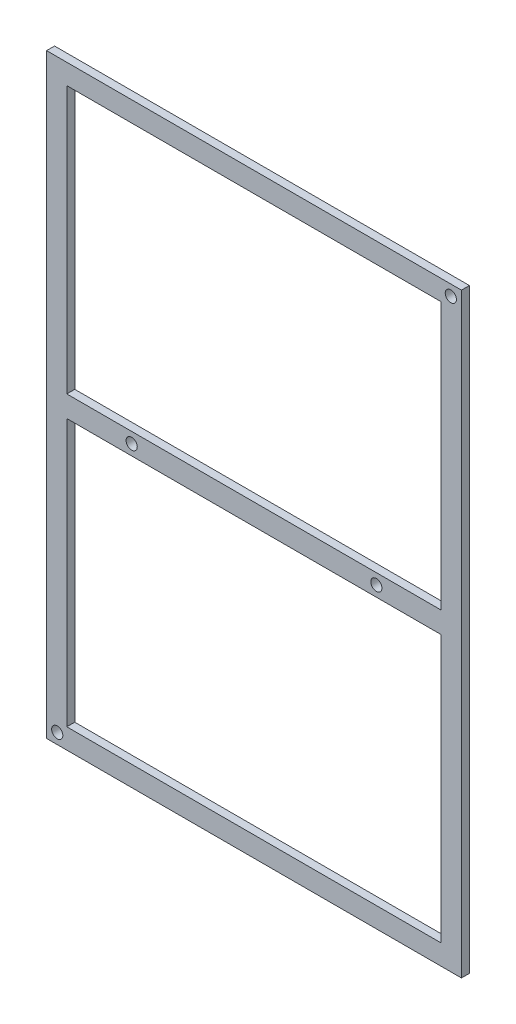
ISO-10303-21;
HEADER;
FILE_DESCRIPTION(('STEP AP214'),'2;1');
FILE_NAME('part.step','',(''),(''),'','','');
FILE_SCHEMA(('AUTOMOTIVE_DESIGN { 1 0 10303 214 1 1 1 1 }'));
ENDSEC;
DATA;
#1=APPLICATION_CONTEXT('core data for automotive mechanical design processes');
#2=APPLICATION_PROTOCOL_DEFINITION('international standard','automotive_design',2000,#1);
#3=PRODUCT_CONTEXT('',#1,'mechanical');
#4=PRODUCT('Part','Part','',(#3));
#5=PRODUCT_RELATED_PRODUCT_CATEGORY('part','',(#4));
#6=PRODUCT_DEFINITION_FORMATION('','',#4);
#7=PRODUCT_DEFINITION_CONTEXT('part definition',#1,'design');
#8=PRODUCT_DEFINITION('design','',#6,#7);
#9=PRODUCT_DEFINITION_SHAPE('','',#8);
#10=(LENGTH_UNIT() NAMED_UNIT(*) SI_UNIT(.MILLI.,.METRE.));
#11=(NAMED_UNIT(*) PLANE_ANGLE_UNIT() SI_UNIT($,.RADIAN.));
#12=(NAMED_UNIT(*) SI_UNIT($,.STERADIAN.) SOLID_ANGLE_UNIT());
#13=UNCERTAINTY_MEASURE_WITH_UNIT(LENGTH_MEASURE(1.E-05),#10,'distance_accuracy_value','');
#14=(GEOMETRIC_REPRESENTATION_CONTEXT(3) GLOBAL_UNCERTAINTY_ASSIGNED_CONTEXT((#13)) GLOBAL_UNIT_ASSIGNED_CONTEXT((#10,
#11,#12)) REPRESENTATION_CONTEXT('',''));
#15=CARTESIAN_POINT('',(0.,0.,0.));
#16=DIRECTION('',(0.,0.,1.));
#17=DIRECTION('',(1.,0.,0.));
#18=AXIS2_PLACEMENT_3D('',#15,#16,#17);
#19=CARTESIAN_POINT('',(-35.1999999999999,0.,1.5));
#20=DIRECTION('',(1.,0.,0.));
#21=DIRECTION('',(0.,0.,-1.));
#22=AXIS2_PLACEMENT_3D('',#19,#20,#21);
#23=PLANE('',#22);
#24=DIRECTION('',(0.,0.,1.));
#25=VECTOR('',#24,1.);
#26=CARTESIAN_POINT('',(-35.1999999999999,1.99999999999999,-70.513544798145));
#27=LINE('',#26,#25);
#28=CARTESIAN_POINT('',(-35.1999999999999,1.99999999999999,0.));
#29=VERTEX_POINT('',#28);
#30=CARTESIAN_POINT('',(-35.1999999999999,1.99999999999999,1.5));
#31=VERTEX_POINT('',#30);
#32=EDGE_CURVE('E222',#29,#31,#27,.T.);
#33=ORIENTED_EDGE('',*,*,#32,.F.);
#34=DIRECTION('',(0.,-1.,0.));
#35=VECTOR('',#34,1.);
#36=CARTESIAN_POINT('',(-35.1999999999999,0.,0.));
#37=LINE('',#36,#35);
#38=CARTESIAN_POINT('',(-35.1999999999999,52.1999999999998,0.));
#39=VERTEX_POINT('',#38);
#40=EDGE_CURVE('E182',#39,#29,#37,.T.);
#41=ORIENTED_EDGE('',*,*,#40,.F.);
#42=DIRECTION('',(0.,0.,-1.));
#43=VECTOR('',#42,1.);
#44=CARTESIAN_POINT('',(-35.1999999999999,52.1999999999998,1.5));
#45=LINE('',#44,#43);
#46=CARTESIAN_POINT('',(-35.1999999999999,52.1999999999998,1.5));
#47=VERTEX_POINT('',#46);
#48=EDGE_CURVE('E211',#47,#39,#45,.T.);
#49=ORIENTED_EDGE('',*,*,#48,.F.);
#50=DIRECTION('',(0.,-1.,0.));
#51=VECTOR('',#50,1.);
#52=CARTESIAN_POINT('',(-35.1999999999999,0.,1.5));
#53=LINE('',#52,#51);
#54=EDGE_CURVE('E155',#47,#31,#53,.T.);
#55=ORIENTED_EDGE('',*,*,#54,.T.);
#56=EDGE_LOOP('',(#33,#41,#49,#55));
#57=FACE_BOUND('',#56,.T.);
#58=ADVANCED_FACE('F39',(#57),#23,.T.);
#59=CARTESIAN_POINT('',(35.2000000000001,0.,1.5));
#60=DIRECTION('',(1.,0.,0.));
#61=DIRECTION('',(0.,0.,-1.));
#62=AXIS2_PLACEMENT_3D('',#59,#60,#61);
#63=PLANE('',#62);
#64=DIRECTION('',(0.,-1.,0.));
#65=VECTOR('',#64,1.);
#66=CARTESIAN_POINT('',(35.2000000000001,0.,0.));
#67=LINE('',#66,#65);
#68=CARTESIAN_POINT('',(35.2000000000001,52.1999999999998,0.));
#69=VERTEX_POINT('',#68);
#70=CARTESIAN_POINT('',(35.2000000000001,1.99999999999999,0.));
#71=VERTEX_POINT('',#70);
#72=EDGE_CURVE('E188',#69,#71,#67,.T.);
#73=ORIENTED_EDGE('',*,*,#72,.T.);
#74=DIRECTION('',(0.,0.,1.));
#75=VECTOR('',#74,1.);
#76=CARTESIAN_POINT('',(35.2000000000001,1.99999999999999,-70.513544798145));
#77=LINE('',#76,#75);
#78=CARTESIAN_POINT('',(35.2000000000001,1.99999999999999,1.5));
#79=VERTEX_POINT('',#78);
#80=EDGE_CURVE('E64',#71,#79,#77,.T.);
#81=ORIENTED_EDGE('',*,*,#80,.T.);
#82=DIRECTION('',(0.,-1.,0.));
#83=VECTOR('',#82,1.);
#84=CARTESIAN_POINT('',(35.2000000000001,0.,1.5));
#85=LINE('',#84,#83);
#86=CARTESIAN_POINT('',(35.2000000000001,52.1999999999998,1.5));
#87=VERTEX_POINT('',#86);
#88=EDGE_CURVE('E164',#87,#79,#85,.T.);
#89=ORIENTED_EDGE('',*,*,#88,.F.);
#90=DIRECTION('',(0.,0.,-1.));
#91=VECTOR('',#90,1.);
#92=CARTESIAN_POINT('',(35.2000000000001,52.1999999999998,1.5));
#93=LINE('',#92,#91);
#94=EDGE_CURVE('E209',#87,#69,#93,.T.);
#95=ORIENTED_EDGE('',*,*,#94,.T.);
#96=EDGE_LOOP('',(#73,#81,#89,#95));
#97=FACE_BOUND('',#96,.T.);
#98=ADVANCED_FACE('F289',(#97),#63,.F.);
#99=CARTESIAN_POINT('',(0.,55.9999999999998,1.5));
#100=DIRECTION('',(0.,1.,0.));
#101=DIRECTION('',(0.,0.,1.));
#102=AXIS2_PLACEMENT_3D('',#99,#100,#101);
#103=PLANE('',#102);
#104=DIRECTION('',(1.,0.,0.));
#105=VECTOR('',#104,1.);
#106=CARTESIAN_POINT('',(0.,55.9999999999998,0.));
#107=LINE('',#106,#105);
#108=CARTESIAN_POINT('',(-38.9999999999999,55.9999999999998,0.));
#109=VERTEX_POINT('',#108);
#110=CARTESIAN_POINT('',(39.0000000000001,55.9999999999998,0.));
#111=VERTEX_POINT('',#110);
#112=EDGE_CURVE('E190',#109,#111,#107,.T.);
#113=ORIENTED_EDGE('',*,*,#112,.F.);
#114=DIRECTION('',(0.,0.,-1.));
#115=VECTOR('',#114,1.);
#116=CARTESIAN_POINT('',(-38.9999999999999,55.9999999999998,1.5));
#117=LINE('',#116,#115);
#118=CARTESIAN_POINT('',(-38.9999999999999,55.9999999999998,1.5));
#119=VERTEX_POINT('',#118);
#120=EDGE_CURVE('E11',#119,#109,#117,.T.);
#121=ORIENTED_EDGE('',*,*,#120,.F.);
#122=DIRECTION('',(1.,0.,0.));
#123=VECTOR('',#122,1.);
#124=CARTESIAN_POINT('',(0.,55.9999999999998,1.5));
#125=LINE('',#124,#123);
#126=CARTESIAN_POINT('',(39.0000000000001,55.9999999999998,1.5));
#127=VERTEX_POINT('',#126);
#128=EDGE_CURVE('E166',#119,#127,#125,.T.);
#129=ORIENTED_EDGE('',*,*,#128,.T.);
#130=DIRECTION('',(0.,0.,-1.));
#131=VECTOR('',#130,1.);
#132=CARTESIAN_POINT('',(39.0000000000001,55.9999999999998,1.5));
#133=LINE('',#132,#131);
#134=EDGE_CURVE('E201',#127,#111,#133,.T.);
#135=ORIENTED_EDGE('',*,*,#134,.T.);
#136=EDGE_LOOP('',(#113,#121,#129,#135));
#137=FACE_BOUND('',#136,.T.);
#138=ADVANCED_FACE('F294',(#137),#103,.T.);
#139=CARTESIAN_POINT('',(-38.9999999999999,0.,1.5));
#140=DIRECTION('',(1.,0.,0.));
#141=DIRECTION('',(0.,1.,0.));
#142=AXIS2_PLACEMENT_3D('',#139,#140,#141);
#143=PLANE('',#142);
#144=DIRECTION('',(0.,-1.,0.));
#145=VECTOR('',#144,1.);
#146=CARTESIAN_POINT('',(-38.9999999999999,0.,0.));
#147=LINE('',#146,#145);
#148=CARTESIAN_POINT('',(-38.9999999999999,-56.0000000000003,0.));
#149=VERTEX_POINT('',#148);
#150=EDGE_CURVE('E193',#109,#149,#147,.T.);
#151=ORIENTED_EDGE('',*,*,#150,.T.);
#152=DIRECTION('',(0.,0.,-1.));
#153=VECTOR('',#152,1.);
#154=CARTESIAN_POINT('',(-38.9999999999999,-56.0000000000003,1.5));
#155=LINE('',#154,#153);
#156=CARTESIAN_POINT('',(-38.9999999999999,-56.0000000000003,1.5));
#157=VERTEX_POINT('',#156);
#158=EDGE_CURVE('E48',#157,#149,#155,.T.);
#159=ORIENTED_EDGE('',*,*,#158,.F.);
#160=DIRECTION('',(0.,-1.,0.));
#161=VECTOR('',#160,1.);
#162=CARTESIAN_POINT('',(-38.9999999999999,0.,1.5));
#163=LINE('',#162,#161);
#164=EDGE_CURVE('E169',#119,#157,#163,.T.);
#165=ORIENTED_EDGE('',*,*,#164,.F.);
#166=ORIENTED_EDGE('',*,*,#120,.T.);
#167=EDGE_LOOP('',(#151,#159,#165,#166));
#168=FACE_BOUND('',#167,.T.);
#169=ADVANCED_FACE('F309',(#168),#143,.F.);
#170=CARTESIAN_POINT('',(0.,-56.0000000000003,1.5));
#171=DIRECTION('',(0.,1.,0.));
#172=DIRECTION('',(0.,0.,1.));
#173=AXIS2_PLACEMENT_3D('',#170,#171,#172);
#174=PLANE('',#173);
#175=DIRECTION('',(1.,0.,0.));
#176=VECTOR('',#175,1.);
#177=CARTESIAN_POINT('',(0.,-56.0000000000003,0.));
#178=LINE('',#177,#176);
#179=CARTESIAN_POINT('',(39.0000000000001,-56.0000000000003,0.));
#180=VERTEX_POINT('',#179);
#181=EDGE_CURVE('E196',#149,#180,#178,.T.);
#182=ORIENTED_EDGE('',*,*,#181,.T.);
#183=DIRECTION('',(0.,0.,-1.));
#184=VECTOR('',#183,1.);
#185=CARTESIAN_POINT('',(39.0000000000001,-56.0000000000003,1.5));
#186=LINE('',#185,#184);
#187=CARTESIAN_POINT('',(39.0000000000001,-56.0000000000003,1.5));
#188=VERTEX_POINT('',#187);
#189=EDGE_CURVE('E203',#188,#180,#186,.T.);
#190=ORIENTED_EDGE('',*,*,#189,.F.);
#191=DIRECTION('',(1.,0.,0.));
#192=VECTOR('',#191,1.);
#193=CARTESIAN_POINT('',(0.,-56.0000000000003,1.5));
#194=LINE('',#193,#192);
#195=EDGE_CURVE('E172',#157,#188,#194,.T.);
#196=ORIENTED_EDGE('',*,*,#195,.F.);
#197=ORIENTED_EDGE('',*,*,#158,.T.);
#198=EDGE_LOOP('',(#182,#190,#196,#197));
#199=FACE_BOUND('',#198,.T.);
#200=ADVANCED_FACE('F305',(#199),#174,.F.);
#201=CARTESIAN_POINT('',(0.,-52.2000000000003,1.5));
#202=DIRECTION('',(0.,1.,0.));
#203=DIRECTION('',(0.,0.,1.));
#204=AXIS2_PLACEMENT_3D('',#201,#202,#203);
#205=PLANE('',#204);
#206=DIRECTION('',(1.,0.,0.));
#207=VECTOR('',#206,1.);
#208=CARTESIAN_POINT('',(0.,-52.2000000000003,0.));
#209=LINE('',#208,#207);
#210=CARTESIAN_POINT('',(-35.1999999999999,-52.2000000000003,0.));
#211=VERTEX_POINT('',#210);
#212=CARTESIAN_POINT('',(35.2000000000001,-52.2000000000003,0.));
#213=VERTEX_POINT('',#212);
#214=EDGE_CURVE('E178',#211,#213,#209,.T.);
#215=ORIENTED_EDGE('',*,*,#214,.F.);
#216=DIRECTION('',(0.,0.,-1.));
#217=VECTOR('',#216,1.);
#218=CARTESIAN_POINT('',(-35.1999999999999,-52.2000000000003,1.5));
#219=LINE('',#218,#217);
#220=CARTESIAN_POINT('',(-35.1999999999999,-52.2000000000003,1.5));
#221=VERTEX_POINT('',#220);
#222=EDGE_CURVE('E43',#221,#211,#219,.T.);
#223=ORIENTED_EDGE('',*,*,#222,.F.);
#224=DIRECTION('',(1.,0.,0.));
#225=VECTOR('',#224,1.);
#226=CARTESIAN_POINT('',(0.,-52.2000000000003,1.5));
#227=LINE('',#226,#225);
#228=CARTESIAN_POINT('',(35.2000000000001,-52.2000000000003,1.5));
#229=VERTEX_POINT('',#228);
#230=EDGE_CURVE('E154',#221,#229,#227,.T.);
#231=ORIENTED_EDGE('',*,*,#230,.T.);
#232=DIRECTION('',(0.,0.,-1.));
#233=VECTOR('',#232,1.);
#234=CARTESIAN_POINT('',(35.2000000000001,-52.2000000000003,1.5));
#235=LINE('',#234,#233);
#236=EDGE_CURVE('E177',#229,#213,#235,.T.);
#237=ORIENTED_EDGE('',*,*,#236,.T.);
#238=EDGE_LOOP('',(#215,#223,#231,#237));
#239=FACE_BOUND('',#238,.T.);
#240=ADVANCED_FACE('F41',(#239),#205,.T.);
#241=DIRECTION('',(0.,0.,1.));
#242=VECTOR('',#241,1.);
#243=CARTESIAN_POINT('',(-35.1999999999999,-1.99999999999999,-70.513544798145));
#244=LINE('',#243,#242);
#245=CARTESIAN_POINT('',(-35.1999999999999,-1.99999999999999,0.));
#246=VERTEX_POINT('',#245);
#247=CARTESIAN_POINT('',(-35.1999999999999,-1.99999999999999,1.5));
#248=VERTEX_POINT('',#247);
#249=EDGE_CURVE('E134',#246,#248,#244,.T.);
#250=ORIENTED_EDGE('',*,*,#249,.T.);
#251=EDGE_CURVE('E146',#248,#221,#53,.T.);
#252=ORIENTED_EDGE('',*,*,#251,.T.);
#253=ORIENTED_EDGE('',*,*,#222,.T.);
#254=EDGE_CURVE('E148',#246,#211,#37,.T.);
#255=ORIENTED_EDGE('',*,*,#254,.F.);
#256=EDGE_LOOP('',(#250,#252,#253,#255));
#257=FACE_BOUND('',#256,.T.);
#258=ADVANCED_FACE('F144',(#257),#23,.T.);
#259=CARTESIAN_POINT('',(0.,52.1999999999998,1.5));
#260=DIRECTION('',(0.,1.,0.));
#261=DIRECTION('',(0.,0.,1.));
#262=AXIS2_PLACEMENT_3D('',#259,#260,#261);
#263=PLANE('',#262);
#264=DIRECTION('',(1.,0.,0.));
#265=VECTOR('',#264,1.);
#266=CARTESIAN_POINT('',(0.,52.1999999999998,0.));
#267=LINE('',#266,#265);
#268=EDGE_CURVE('E185',#39,#69,#267,.T.);
#269=ORIENTED_EDGE('',*,*,#268,.T.);
#270=ORIENTED_EDGE('',*,*,#94,.F.);
#271=DIRECTION('',(1.,0.,0.));
#272=VECTOR('',#271,1.);
#273=CARTESIAN_POINT('',(0.,52.1999999999998,1.5));
#274=LINE('',#273,#272);
#275=EDGE_CURVE('E158',#47,#87,#274,.T.);
#276=ORIENTED_EDGE('',*,*,#275,.F.);
#277=ORIENTED_EDGE('',*,*,#48,.T.);
#278=EDGE_LOOP('',(#269,#270,#276,#277));
#279=FACE_BOUND('',#278,.T.);
#280=ADVANCED_FACE('F300',(#279),#263,.F.);
#281=CARTESIAN_POINT('',(35.2000000000001,-1.99999999999999,1.5));
#282=VERTEX_POINT('',#281);
#283=EDGE_CURVE('E56',#282,#229,#85,.T.);
#284=ORIENTED_EDGE('',*,*,#283,.F.);
#285=DIRECTION('',(0.,0.,1.));
#286=VECTOR('',#285,1.);
#287=CARTESIAN_POINT('',(35.2000000000001,-1.99999999999999,-70.513544798145));
#288=LINE('',#287,#286);
#289=CARTESIAN_POINT('',(35.2000000000001,-1.99999999999999,0.));
#290=VERTEX_POINT('',#289);
#291=EDGE_CURVE('E136',#290,#282,#288,.T.);
#292=ORIENTED_EDGE('',*,*,#291,.F.);
#293=EDGE_CURVE('E187',#290,#213,#67,.T.);
#294=ORIENTED_EDGE('',*,*,#293,.T.);
#295=ORIENTED_EDGE('',*,*,#236,.F.);
#296=EDGE_LOOP('',(#284,#292,#294,#295));
#297=FACE_BOUND('',#296,.T.);
#298=ADVANCED_FACE('F296',(#297),#63,.F.);
#299=CARTESIAN_POINT('',(39.0000000000001,0.,1.5));
#300=DIRECTION('',(1.,0.,0.));
#301=DIRECTION('',(0.,1.,0.));
#302=AXIS2_PLACEMENT_3D('',#299,#300,#301);
#303=PLANE('',#302);
#304=DIRECTION('',(0.,-1.,0.));
#305=VECTOR('',#304,1.);
#306=CARTESIAN_POINT('',(39.0000000000001,0.,0.));
#307=LINE('',#306,#305);
#308=EDGE_CURVE('E159',#111,#180,#307,.T.);
#309=ORIENTED_EDGE('',*,*,#308,.F.);
#310=ORIENTED_EDGE('',*,*,#134,.F.);
#311=DIRECTION('',(0.,-1.,0.));
#312=VECTOR('',#311,1.);
#313=CARTESIAN_POINT('',(39.0000000000001,0.,1.5));
#314=LINE('',#313,#312);
#315=EDGE_CURVE('E174',#127,#188,#314,.T.);
#316=ORIENTED_EDGE('',*,*,#315,.T.);
#317=ORIENTED_EDGE('',*,*,#189,.T.);
#318=EDGE_LOOP('',(#309,#310,#316,#317));
#319=FACE_BOUND('',#318,.T.);
#320=ADVANCED_FACE('F265',(#319),#303,.T.);
#321=CARTESIAN_POINT('',(0.,0.,1.5));
#322=DIRECTION('',(0.,0.,1.));
#323=DIRECTION('',(1.,0.,0.));
#324=AXIS2_PLACEMENT_3D('',#321,#322,#323);
#325=PLANE('',#324);
#326=CARTESIAN_POINT('',(37.0000000000001,53.9999999999998,1.5));
#327=DIRECTION('',(0.,0.,1.));
#328=DIRECTION('',(1.,0.,0.));
#329=AXIS2_PLACEMENT_3D('',#326,#327,#328);
#330=CIRCLE('',#329,1.05);
#331=CARTESIAN_POINT('',(38.0500000000001,53.9999999999998,1.5));
#332=VERTEX_POINT('',#331);
#333=EDGE_CURVE('E248',#332,#332,#330,.T.);
#334=ORIENTED_EDGE('',*,*,#333,.F.);
#335=EDGE_LOOP('',(#334));
#336=FACE_BOUND('',#335,.T.);
#337=CARTESIAN_POINT('',(23.0000000000001,0.,1.5));
#338=DIRECTION('',(0.,0.,1.));
#339=DIRECTION('',(1.,0.,0.));
#340=AXIS2_PLACEMENT_3D('',#337,#338,#339);
#341=CIRCLE('',#340,1.05);
#342=CARTESIAN_POINT('',(24.0500000000001,0.,1.5));
#343=VERTEX_POINT('',#342);
#344=EDGE_CURVE('E245',#343,#343,#341,.T.);
#345=ORIENTED_EDGE('',*,*,#344,.F.);
#346=EDGE_LOOP('',(#345));
#347=FACE_BOUND('',#346,.T.);
#348=CARTESIAN_POINT('',(-22.9999999999999,0.,1.5));
#349=DIRECTION('',(0.,0.,1.));
#350=DIRECTION('',(1.,0.,0.));
#351=AXIS2_PLACEMENT_3D('',#348,#349,#350);
#352=CIRCLE('',#351,1.05);
#353=CARTESIAN_POINT('',(-21.9499999999999,0.,1.5));
#354=VERTEX_POINT('',#353);
#355=EDGE_CURVE('E239',#354,#354,#352,.T.);
#356=ORIENTED_EDGE('',*,*,#355,.F.);
#357=EDGE_LOOP('',(#356));
#358=FACE_BOUND('',#357,.T.);
#359=CARTESIAN_POINT('',(-36.9999999999999,-54.0000000000003,1.5));
#360=DIRECTION('',(0.,0.,1.));
#361=DIRECTION('',(1.,0.,0.));
#362=AXIS2_PLACEMENT_3D('',#359,#360,#361);
#363=CIRCLE('',#362,1.05);
#364=CARTESIAN_POINT('',(-35.9499999999999,-54.0000000000003,1.5));
#365=VERTEX_POINT('',#364);
#366=EDGE_CURVE('E233',#365,#365,#363,.T.);
#367=ORIENTED_EDGE('',*,*,#366,.F.);
#368=EDGE_LOOP('',(#367));
#369=FACE_BOUND('',#368,.T.);
#370=ORIENTED_EDGE('',*,*,#251,.F.);
#371=DIRECTION('',(1.,0.,0.));
#372=VECTOR('',#371,1.);
#373=CARTESIAN_POINT('',(-35.1999999999999,-1.99999999999999,1.5));
#374=LINE('',#373,#372);
#375=EDGE_CURVE('E130',#248,#282,#374,.T.);
#376=ORIENTED_EDGE('',*,*,#375,.T.);
#377=ORIENTED_EDGE('',*,*,#283,.T.);
#378=ORIENTED_EDGE('',*,*,#230,.F.);
#379=EDGE_LOOP('',(#370,#376,#377,#378));
#380=FACE_BOUND('',#379,.T.);
#381=DIRECTION('',(-1.,0.,0.));
#382=VECTOR('',#381,1.);
#383=CARTESIAN_POINT('',(-35.1999999999999,1.99999999999999,1.5));
#384=LINE('',#383,#382);
#385=EDGE_CURVE('E139',#79,#31,#384,.T.);
#386=ORIENTED_EDGE('',*,*,#385,.T.);
#387=ORIENTED_EDGE('',*,*,#54,.F.);
#388=ORIENTED_EDGE('',*,*,#275,.T.);
#389=ORIENTED_EDGE('',*,*,#88,.T.);
#390=EDGE_LOOP('',(#386,#387,#388,#389));
#391=FACE_BOUND('',#390,.T.);
#392=ORIENTED_EDGE('',*,*,#128,.F.);
#393=ORIENTED_EDGE('',*,*,#164,.T.);
#394=ORIENTED_EDGE('',*,*,#195,.T.);
#395=ORIENTED_EDGE('',*,*,#315,.F.);
#396=EDGE_LOOP('',(#392,#393,#394,#395));
#397=FACE_BOUND('',#396,.T.);
#398=ADVANCED_FACE('F151',(#336,#347,#358,#369,#380,#391,#397),#325,.T.);
#399=CARTESIAN_POINT('',(0.,0.,0.));
#400=DIRECTION('',(0.,0.,1.));
#401=DIRECTION('',(1.,0.,0.));
#402=AXIS2_PLACEMENT_3D('',#399,#400,#401);
#403=PLANE('',#402);
#404=CARTESIAN_POINT('',(37.0000000000001,53.9999999999998,0.));
#405=DIRECTION('',(0.,0.,1.));
#406=DIRECTION('',(1.,0.,0.));
#407=AXIS2_PLACEMENT_3D('',#404,#405,#406);
#408=CIRCLE('',#407,1.05);
#409=CARTESIAN_POINT('',(38.0500000000001,53.9999999999998,0.));
#410=VERTEX_POINT('',#409);
#411=EDGE_CURVE('E140',#410,#410,#408,.T.);
#412=ORIENTED_EDGE('',*,*,#411,.T.);
#413=EDGE_LOOP('',(#412));
#414=FACE_BOUND('',#413,.T.);
#415=CARTESIAN_POINT('',(23.0000000000001,0.,0.));
#416=DIRECTION('',(0.,0.,1.));
#417=DIRECTION('',(1.,0.,0.));
#418=AXIS2_PLACEMENT_3D('',#415,#416,#417);
#419=CIRCLE('',#418,1.05);
#420=CARTESIAN_POINT('',(24.0500000000001,0.,0.));
#421=VERTEX_POINT('',#420);
#422=EDGE_CURVE('E242',#421,#421,#419,.T.);
#423=ORIENTED_EDGE('',*,*,#422,.T.);
#424=EDGE_LOOP('',(#423));
#425=FACE_BOUND('',#424,.T.);
#426=CARTESIAN_POINT('',(-22.9999999999999,0.,0.));
#427=DIRECTION('',(0.,0.,1.));
#428=DIRECTION('',(1.,0.,0.));
#429=AXIS2_PLACEMENT_3D('',#426,#427,#428);
#430=CIRCLE('',#429,1.05);
#431=CARTESIAN_POINT('',(-21.9499999999999,0.,0.));
#432=VERTEX_POINT('',#431);
#433=EDGE_CURVE('E236',#432,#432,#430,.T.);
#434=ORIENTED_EDGE('',*,*,#433,.T.);
#435=EDGE_LOOP('',(#434));
#436=FACE_BOUND('',#435,.T.);
#437=CARTESIAN_POINT('',(-36.9999999999999,-54.0000000000003,0.));
#438=DIRECTION('',(0.,0.,1.));
#439=DIRECTION('',(1.,0.,0.));
#440=AXIS2_PLACEMENT_3D('',#437,#438,#439);
#441=CIRCLE('',#440,1.05);
#442=CARTESIAN_POINT('',(-35.9499999999999,-54.0000000000003,0.));
#443=VERTEX_POINT('',#442);
#444=EDGE_CURVE('E230',#443,#443,#441,.T.);
#445=ORIENTED_EDGE('',*,*,#444,.T.);
#446=EDGE_LOOP('',(#445));
#447=FACE_BOUND('',#446,.T.);
#448=ORIENTED_EDGE('',*,*,#40,.T.);
#449=DIRECTION('',(1.,0.,0.));
#450=VECTOR('',#449,1.);
#451=CARTESIAN_POINT('',(-35.1999999999999,1.99999999999999,0.));
#452=LINE('',#451,#450);
#453=EDGE_CURVE('E220',#29,#71,#452,.T.);
#454=ORIENTED_EDGE('',*,*,#453,.T.);
#455=ORIENTED_EDGE('',*,*,#72,.F.);
#456=ORIENTED_EDGE('',*,*,#268,.F.);
#457=EDGE_LOOP('',(#448,#454,#455,#456));
#458=FACE_BOUND('',#457,.T.);
#459=ORIENTED_EDGE('',*,*,#214,.T.);
#460=ORIENTED_EDGE('',*,*,#293,.F.);
#461=DIRECTION('',(-1.,0.,0.));
#462=VECTOR('',#461,1.);
#463=CARTESIAN_POINT('',(-35.1999999999999,-1.99999999999999,0.));
#464=LINE('',#463,#462);
#465=EDGE_CURVE('E181',#290,#246,#464,.T.);
#466=ORIENTED_EDGE('',*,*,#465,.T.);
#467=ORIENTED_EDGE('',*,*,#254,.T.);
#468=EDGE_LOOP('',(#459,#460,#466,#467));
#469=FACE_BOUND('',#468,.T.);
#470=ORIENTED_EDGE('',*,*,#112,.T.);
#471=ORIENTED_EDGE('',*,*,#308,.T.);
#472=ORIENTED_EDGE('',*,*,#181,.F.);
#473=ORIENTED_EDGE('',*,*,#150,.F.);
#474=EDGE_LOOP('',(#470,#471,#472,#473));
#475=FACE_BOUND('',#474,.T.);
#476=ADVANCED_FACE('F218',(#414,#425,#436,#447,#458,#469,#475),#403,.F.);
#477=CARTESIAN_POINT('',(-35.1999999999999,1.99999999999999,-70.513544798145));
#478=DIRECTION('',(0.,1.,0.));
#479=DIRECTION('',(0.,0.,1.));
#480=AXIS2_PLACEMENT_3D('',#477,#478,#479);
#481=PLANE('',#480);
#482=ORIENTED_EDGE('',*,*,#453,.F.);
#483=ORIENTED_EDGE('',*,*,#32,.T.);
#484=ORIENTED_EDGE('',*,*,#385,.F.);
#485=ORIENTED_EDGE('',*,*,#80,.F.);
#486=EDGE_LOOP('',(#482,#483,#484,#485));
#487=FACE_BOUND('',#486,.T.);
#488=ADVANCED_FACE('F284',(#487),#481,.T.);
#489=CARTESIAN_POINT('',(-35.1999999999999,-1.99999999999999,-70.513544798145));
#490=DIRECTION('',(0.,-1.,0.));
#491=DIRECTION('',(0.,0.,-1.));
#492=AXIS2_PLACEMENT_3D('',#489,#490,#491);
#493=PLANE('',#492);
#494=ORIENTED_EDGE('',*,*,#465,.F.);
#495=ORIENTED_EDGE('',*,*,#291,.T.);
#496=ORIENTED_EDGE('',*,*,#375,.F.);
#497=ORIENTED_EDGE('',*,*,#249,.F.);
#498=EDGE_LOOP('',(#494,#495,#496,#497));
#499=FACE_BOUND('',#498,.T.);
#500=ADVANCED_FACE('F133',(#499),#493,.T.);
#501=CARTESIAN_POINT('',(-36.9999999999999,-54.0000000000003,0.));
#502=DIRECTION('',(0.,0.,1.));
#503=DIRECTION('',(1.,0.,0.));
#504=AXIS2_PLACEMENT_3D('',#501,#502,#503);
#505=CYLINDRICAL_SURFACE('',#504,1.05);
#506=ORIENTED_EDGE('',*,*,#444,.F.);
#507=EDGE_LOOP('',(#506));
#508=FACE_BOUND('',#507,.T.);
#509=ORIENTED_EDGE('',*,*,#366,.T.);
#510=EDGE_LOOP('',(#509));
#511=FACE_BOUND('',#510,.T.);
#512=ADVANCED_FACE('F273',(#508,#511),#505,.F.);
#513=CARTESIAN_POINT('',(-22.9999999999999,0.,0.));
#514=DIRECTION('',(0.,0.,1.));
#515=DIRECTION('',(1.,0.,0.));
#516=AXIS2_PLACEMENT_3D('',#513,#514,#515);
#517=CYLINDRICAL_SURFACE('',#516,1.05);
#518=ORIENTED_EDGE('',*,*,#433,.F.);
#519=EDGE_LOOP('',(#518));
#520=FACE_BOUND('',#519,.T.);
#521=ORIENTED_EDGE('',*,*,#355,.T.);
#522=EDGE_LOOP('',(#521));
#523=FACE_BOUND('',#522,.T.);
#524=ADVANCED_FACE('F275',(#520,#523),#517,.F.);
#525=CARTESIAN_POINT('',(23.0000000000001,0.,0.));
#526=DIRECTION('',(0.,0.,1.));
#527=DIRECTION('',(1.,0.,0.));
#528=AXIS2_PLACEMENT_3D('',#525,#526,#527);
#529=CYLINDRICAL_SURFACE('',#528,1.05);
#530=ORIENTED_EDGE('',*,*,#422,.F.);
#531=EDGE_LOOP('',(#530));
#532=FACE_BOUND('',#531,.T.);
#533=ORIENTED_EDGE('',*,*,#344,.T.);
#534=EDGE_LOOP('',(#533));
#535=FACE_BOUND('',#534,.T.);
#536=ADVANCED_FACE('F259',(#532,#535),#529,.F.);
#537=CARTESIAN_POINT('',(37.0000000000001,53.9999999999998,0.));
#538=DIRECTION('',(0.,0.,1.));
#539=DIRECTION('',(1.,0.,0.));
#540=AXIS2_PLACEMENT_3D('',#537,#538,#539);
#541=CYLINDRICAL_SURFACE('',#540,1.05);
#542=ORIENTED_EDGE('',*,*,#411,.F.);
#543=EDGE_LOOP('',(#542));
#544=FACE_BOUND('',#543,.T.);
#545=ORIENTED_EDGE('',*,*,#333,.T.);
#546=EDGE_LOOP('',(#545));
#547=FACE_BOUND('',#546,.T.);
#548=ADVANCED_FACE('F256',(#544,#547),#541,.F.);
#549=CLOSED_SHELL('',(#58,#98,#138,#169,#200,#240,#258,#280,#298,#320,#398,#476,#488,#500,#512,
#524,#536,#548));
#550=MANIFOLD_SOLID_BREP('B2',#549);
#551=ADVANCED_BREP_SHAPE_REPRESENTATION('',(#18,#550),#14);
#552=SHAPE_DEFINITION_REPRESENTATION(#9,#551);
ENDSEC;
END-ISO-10303-21;
